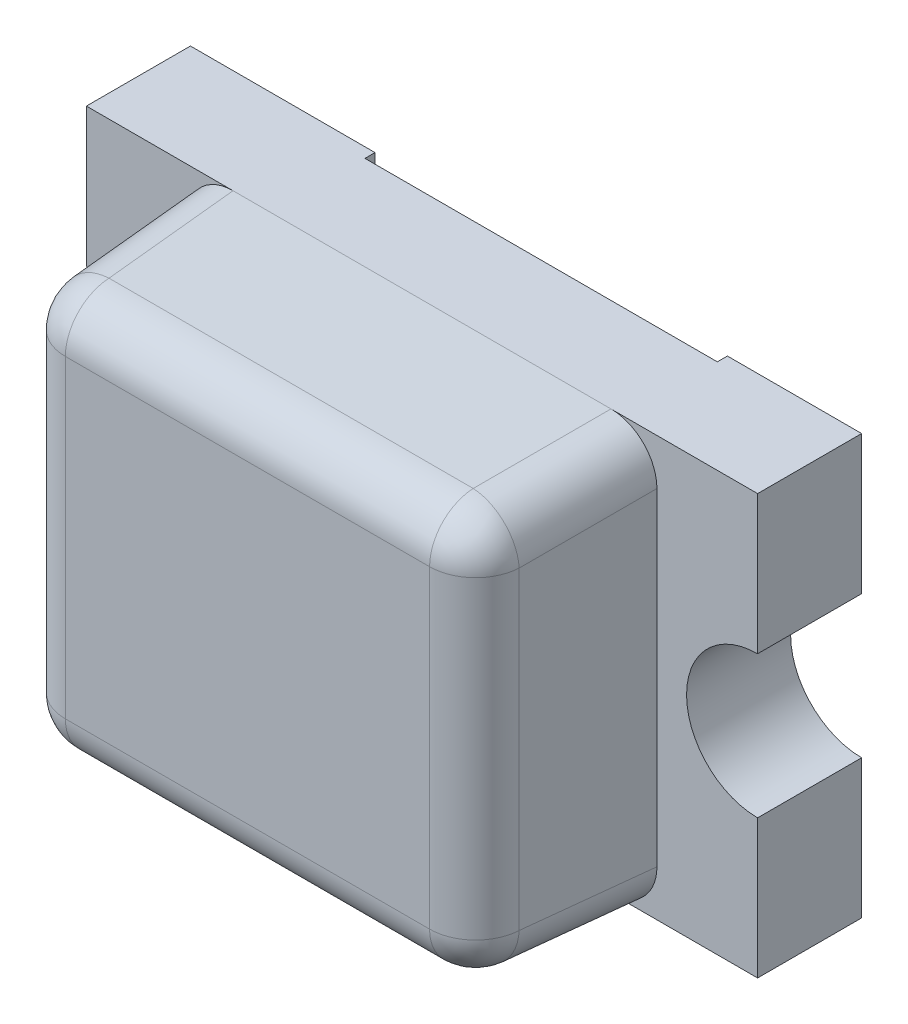
ISO-10303-21;
HEADER;
FILE_DESCRIPTION(('STEP AP214'),'2;1');
FILE_NAME('part.step','',(''),(''),'','','');
FILE_SCHEMA(('AUTOMOTIVE_DESIGN { 1 0 10303 214 1 1 1 1 }'));
ENDSEC;
DATA;
#1=APPLICATION_CONTEXT('core data for automotive mechanical design processes');
#2=APPLICATION_PROTOCOL_DEFINITION('international standard','automotive_design',2000,#1);
#3=PRODUCT_CONTEXT('',#1,'mechanical');
#4=PRODUCT('Part','Part','',(#3));
#5=PRODUCT_RELATED_PRODUCT_CATEGORY('part','',(#4));
#6=PRODUCT_DEFINITION_FORMATION('','',#4);
#7=PRODUCT_DEFINITION_CONTEXT('part definition',#1,'design');
#8=PRODUCT_DEFINITION('design','',#6,#7);
#9=PRODUCT_DEFINITION_SHAPE('','',#8);
#10=(LENGTH_UNIT() NAMED_UNIT(*) SI_UNIT(.MILLI.,.METRE.));
#11=(NAMED_UNIT(*) PLANE_ANGLE_UNIT() SI_UNIT($,.RADIAN.));
#12=(NAMED_UNIT(*) SI_UNIT($,.STERADIAN.) SOLID_ANGLE_UNIT());
#13=UNCERTAINTY_MEASURE_WITH_UNIT(LENGTH_MEASURE(1.E-05),#10,'distance_accuracy_value','');
#14=(GEOMETRIC_REPRESENTATION_CONTEXT(3) GLOBAL_UNCERTAINTY_ASSIGNED_CONTEXT((#13)) GLOBAL_UNIT_ASSIGNED_CONTEXT((#10,
#11,#12)) REPRESENTATION_CONTEXT('',''));
#15=CARTESIAN_POINT('',(0.,0.,0.));
#16=DIRECTION('',(0.,0.,1.));
#17=DIRECTION('',(1.,0.,0.));
#18=AXIS2_PLACEMENT_3D('',#15,#16,#17);
#19=CARTESIAN_POINT('',(0.163168531233106,-0.486831468766896,0.325652261310296));
#20=DIRECTION('',(-0.0522644276887139,-0.0522644276887139,-0.997264688634237));
#21=DIRECTION('',(0.,0.998629534754574,-0.0523359562429438));
#22=AXIS2_PLACEMENT_3D('',#19,#20,#21);
#23=CYLINDRICAL_SURFACE('',#22,0.13716);
#24=CARTESIAN_POINT('',(0.182412025197795,-0.467587974802207,0.69284));
#25=DIRECTION('',(0.052264427688714,0.052264427688714,0.997264688634237));
#26=DIRECTION('',(0.,-0.998629534754574,0.0523359562429439));
#27=AXIS2_PLACEMENT_3D('',#24,#25,#26);
#28=CIRCLE('',#27,0.13716);
#29=CARTESIAN_POINT('',(0.0454399982108576,-0.467587974802207,0.700018399758282));
#30=VERTEX_POINT('',#29);
#31=CARTESIAN_POINT('',(0.182412025197795,-0.604560001789144,0.700018399758282));
#32=VERTEX_POINT('',#31);
#33=EDGE_CURVE('E305',#30,#32,#28,.T.);
#34=ORIENTED_EDGE('',*,*,#33,.F.);
#35=DIRECTION('',(0.0522644276887139,0.0522644276887139,0.997264688634237));
#36=VECTOR('',#35,1.);
#37=CARTESIAN_POINT('',(0.02633308276625,-0.486694890246814,0.335436734478859));
#38=LINE('',#37,#36);
#39=CARTESIAN_POINT('',(0.0250000000000006,-0.488027973013064,0.31));
#40=VERTEX_POINT('',#39);
#41=EDGE_CURVE('E43',#40,#30,#38,.T.);
#42=ORIENTED_EDGE('',*,*,#41,.F.);
#43=CARTESIAN_POINT('',(0.162348230977076,-0.487651769022926,0.31));
#44=DIRECTION('',(0.,0.,1.));
#45=DIRECTION('',(-0.707106781186547,-0.707106781186548,0.));
#46=AXIS2_PLACEMENT_3D('',#43,#44,#45);
#47=ELLIPSE('',#46,0.137536204342943,0.13716);
#48=CARTESIAN_POINT('',(0.161972026986938,-0.625,0.31));
#49=VERTEX_POINT('',#48);
#50=EDGE_CURVE('E11',#40,#49,#47,.T.);
#51=ORIENTED_EDGE('',*,*,#50,.T.);
#52=DIRECTION('',(0.0522644276887139,0.0522644276887139,0.997264688634237));
#53=VECTOR('',#52,1.);
#54=CARTESIAN_POINT('',(0.163168531233106,-0.623803495753833,0.332830661068578));
#55=LINE('',#54,#53);
#56=EDGE_CURVE('E29',#49,#32,#55,.T.);
#57=ORIENTED_EDGE('',*,*,#56,.T.);
#58=EDGE_LOOP('',(#34,#42,#51,#57));
#59=FACE_BOUND('',#58,.T.);
#60=ADVANCED_FACE('F18',(#59),#23,.T.);
#61=CARTESIAN_POINT('',(0.182412025197795,-0.467587974802207,0.69284));
#62=DIRECTION('',(0.,0.,1.));
#63=DIRECTION('',(1.,0.,0.));
#64=AXIS2_PLACEMENT_3D('',#61,#62,#63);
#65=SPHERICAL_SURFACE('',#64,0.13716);
#66=CARTESIAN_POINT('',(0.182412025197795,-0.467587974802207,0.69284));
#67=DIRECTION('',(-1.,0.,0.));
#68=DIRECTION('',(0.,0.,1.));
#69=AXIS2_PLACEMENT_3D('',#66,#67,#68);
#70=CIRCLE('',#69,0.13716);
#71=CARTESIAN_POINT('',(0.182412025197795,-0.467587974802207,0.83));
#72=VERTEX_POINT('',#71);
#73=EDGE_CURVE('E304',#32,#72,#70,.T.);
#74=ORIENTED_EDGE('',*,*,#73,.T.);
#75=CARTESIAN_POINT('',(0.182412025197795,-0.467587974802207,0.69284));
#76=DIRECTION('',(0.,-1.,0.));
#77=DIRECTION('',(0.,0.,-1.));
#78=AXIS2_PLACEMENT_3D('',#75,#76,#77);
#79=CIRCLE('',#78,0.13716);
#80=EDGE_CURVE('E300',#72,#30,#79,.T.);
#81=ORIENTED_EDGE('',*,*,#80,.T.);
#82=ORIENTED_EDGE('',*,*,#33,.T.);
#83=EDGE_LOOP('',(#74,#81,#82));
#84=FACE_BOUND('',#83,.T.);
#85=ADVANCED_FACE('F898',(#84),#65,.T.);
#86=CARTESIAN_POINT('',(0.,-0.467587974802207,0.69284));
#87=DIRECTION('',(1.,0.,0.));
#88=DIRECTION('',(0.,1.,0.));
#89=AXIS2_PLACEMENT_3D('',#86,#87,#88);
#90=CYLINDRICAL_SURFACE('',#89,0.13716);
#91=CARTESIAN_POINT('',(1.26758797480221,-0.467587974802207,0.69284));
#92=DIRECTION('',(1.,0.,0.));
#93=DIRECTION('',(0.,0.,-1.));
#94=AXIS2_PLACEMENT_3D('',#91,#92,#93);
#95=CIRCLE('',#94,0.13716);
#96=CARTESIAN_POINT('',(1.26758797480221,-0.467587974802207,0.83));
#97=VERTEX_POINT('',#96);
#98=CARTESIAN_POINT('',(1.26758797480221,-0.604560001789144,0.700018399758282));
#99=VERTEX_POINT('',#98);
#100=EDGE_CURVE('E365',#97,#99,#95,.T.);
#101=ORIENTED_EDGE('',*,*,#100,.F.);
#102=DIRECTION('',(-1.,0.,0.));
#103=VECTOR('',#102,1.);
#104=CARTESIAN_POINT('',(1.39774795477282,-0.467587974802207,0.83));
#105=LINE('',#104,#103);
#106=EDGE_CURVE('E464',#97,#72,#105,.T.);
#107=ORIENTED_EDGE('',*,*,#106,.T.);
#108=ORIENTED_EDGE('',*,*,#73,.F.);
#109=DIRECTION('',(1.,0.,0.));
#110=VECTOR('',#109,1.);
#111=CARTESIAN_POINT('',(0.0522520452271821,-0.604560001789144,0.700018399758282));
#112=LINE('',#111,#110);
#113=EDGE_CURVE('E468',#32,#99,#112,.T.);
#114=ORIENTED_EDGE('',*,*,#113,.T.);
#115=EDGE_LOOP('',(#101,#107,#108,#114));
#116=FACE_BOUND('',#115,.T.);
#117=ADVANCED_FACE('F844',(#116),#90,.T.);
#118=CARTESIAN_POINT('',(0.182412025197795,0.,0.69284));
#119=DIRECTION('',(0.,-1.,0.));
#120=DIRECTION('',(1.,0.,0.));
#121=AXIS2_PLACEMENT_3D('',#118,#119,#120);
#122=CYLINDRICAL_SURFACE('',#121,0.13716);
#123=CARTESIAN_POINT('',(0.182412025197795,0.467587974802206,0.69284));
#124=DIRECTION('',(0.,1.,0.));
#125=DIRECTION('',(0.,0.,1.));
#126=AXIS2_PLACEMENT_3D('',#123,#124,#125);
#127=CIRCLE('',#126,0.13716);
#128=CARTESIAN_POINT('',(0.0454399982108576,0.467587974802206,0.700018399758282));
#129=VERTEX_POINT('',#128);
#130=CARTESIAN_POINT('',(0.182412025197795,0.467587974802206,0.83));
#131=VERTEX_POINT('',#130);
#132=EDGE_CURVE('E371',#129,#131,#127,.T.);
#133=ORIENTED_EDGE('',*,*,#132,.F.);
#134=DIRECTION('',(0.,-1.,0.));
#135=VECTOR('',#134,1.);
#136=CARTESIAN_POINT('',(0.0454399982108575,0.597747954772819,0.700018399758282));
#137=LINE('',#136,#135);
#138=EDGE_CURVE('E309',#129,#30,#137,.T.);
#139=ORIENTED_EDGE('',*,*,#138,.T.);
#140=ORIENTED_EDGE('',*,*,#80,.F.);
#141=DIRECTION('',(0.,1.,0.));
#142=VECTOR('',#141,1.);
#143=CARTESIAN_POINT('',(0.182412025197795,-0.597747954772819,0.83));
#144=LINE('',#143,#142);
#145=EDGE_CURVE('E298',#72,#131,#144,.T.);
#146=ORIENTED_EDGE('',*,*,#145,.T.);
#147=EDGE_LOOP('',(#133,#139,#140,#146));
#148=FACE_BOUND('',#147,.T.);
#149=ADVANCED_FACE('F627',(#148),#122,.T.);
#150=CARTESIAN_POINT('',(1.26758797480221,-0.467587974802207,0.69284));
#151=DIRECTION('',(0.,0.,1.));
#152=DIRECTION('',(1.,0.,0.));
#153=AXIS2_PLACEMENT_3D('',#150,#151,#152);
#154=SPHERICAL_SURFACE('',#153,0.13716);
#155=CARTESIAN_POINT('',(1.26758797480221,-0.467587974802206,0.69284));
#156=DIRECTION('',(-0.052264427688714,0.052264427688714,0.997264688634237));
#157=DIRECTION('',(0.,-0.998629534754574,0.0523359562429439));
#158=AXIS2_PLACEMENT_3D('',#155,#156,#157);
#159=CIRCLE('',#158,0.13716);
#160=CARTESIAN_POINT('',(1.40456000178914,-0.467587974802207,0.700018399758282));
#161=VERTEX_POINT('',#160);
#162=EDGE_CURVE('E294',#99,#161,#159,.T.);
#163=ORIENTED_EDGE('',*,*,#162,.T.);
#164=CARTESIAN_POINT('',(1.26758797480221,-0.467587974802207,0.69284));
#165=DIRECTION('',(0.,-1.,0.));
#166=DIRECTION('',(0.,0.,-1.));
#167=AXIS2_PLACEMENT_3D('',#164,#165,#166);
#168=CIRCLE('',#167,0.13716);
#169=EDGE_CURVE('E299',#161,#97,#168,.T.);
#170=ORIENTED_EDGE('',*,*,#169,.T.);
#171=ORIENTED_EDGE('',*,*,#100,.T.);
#172=EDGE_LOOP('',(#163,#170,#171));
#173=FACE_BOUND('',#172,.T.);
#174=ADVANCED_FACE('F819',(#173),#154,.T.);
#175=CARTESIAN_POINT('',(0.182412025197795,0.467587974802206,0.69284));
#176=DIRECTION('',(0.,0.,1.));
#177=DIRECTION('',(1.,0.,0.));
#178=AXIS2_PLACEMENT_3D('',#175,#176,#177);
#179=SPHERICAL_SURFACE('',#178,0.13716);
#180=CARTESIAN_POINT('',(0.182412025197795,0.467587974802206,0.69284));
#181=DIRECTION('',(-1.,0.,0.));
#182=DIRECTION('',(0.,-1.,0.));
#183=AXIS2_PLACEMENT_3D('',#180,#181,#182);
#184=CIRCLE('',#183,0.13716);
#185=CARTESIAN_POINT('',(0.182412025197795,0.604560001789144,0.700018399758282));
#186=VERTEX_POINT('',#185);
#187=EDGE_CURVE('E370',#131,#186,#184,.T.);
#188=ORIENTED_EDGE('',*,*,#187,.T.);
#189=CARTESIAN_POINT('',(0.182412025197795,0.467587974802206,0.69284));
#190=DIRECTION('',(0.052264427688714,-0.052264427688714,0.997264688634237));
#191=DIRECTION('',(0.998629534754574,0.,-0.0523359562429439));
#192=AXIS2_PLACEMENT_3D('',#189,#190,#191);
#193=CIRCLE('',#192,0.13716);
#194=EDGE_CURVE('E366',#186,#129,#193,.T.);
#195=ORIENTED_EDGE('',*,*,#194,.T.);
#196=ORIENTED_EDGE('',*,*,#132,.T.);
#197=EDGE_LOOP('',(#188,#195,#196));
#198=FACE_BOUND('',#197,.T.);
#199=ADVANCED_FACE('F619',(#198),#179,.T.);
#200=CARTESIAN_POINT('',(1.28669489024681,-0.486694890246814,0.328258334720577));
#201=DIRECTION('',(0.0522644276887139,-0.0522644276887139,-0.997264688634237));
#202=DIRECTION('',(-0.998629534754574,0.,-0.0523359562429438));
#203=AXIS2_PLACEMENT_3D('',#200,#201,#202);
#204=CYLINDRICAL_SURFACE('',#203,0.13716);
#205=CARTESIAN_POINT('',(1.28765176902293,-0.487651769022926,0.31));
#206=DIRECTION('',(0.,0.,1.));
#207=DIRECTION('',(0.707106781186548,-0.707106781186547,0.));
#208=AXIS2_PLACEMENT_3D('',#205,#206,#207);
#209=ELLIPSE('',#208,0.137536204342943,0.13716);
#210=CARTESIAN_POINT('',(1.28802797301306,-0.625,0.31));
#211=VERTEX_POINT('',#210);
#212=CARTESIAN_POINT('',(1.425,-0.488027973013063,0.31));
#213=VERTEX_POINT('',#212);
#214=EDGE_CURVE('E459',#211,#213,#209,.T.);
#215=ORIENTED_EDGE('',*,*,#214,.T.);
#216=DIRECTION('',(-0.0522644276887139,0.0522644276887139,0.997264688634237));
#217=VECTOR('',#216,1.);
#218=CARTESIAN_POINT('',(1.42366691723375,-0.486694890246814,0.335436734478859));
#219=LINE('',#218,#217);
#220=EDGE_CURVE('E463',#213,#161,#219,.T.);
#221=ORIENTED_EDGE('',*,*,#220,.T.);
#222=ORIENTED_EDGE('',*,*,#162,.F.);
#223=DIRECTION('',(-0.0522644276887139,0.0522644276887139,0.997264688634237));
#224=VECTOR('',#223,1.);
#225=CARTESIAN_POINT('',(1.28614857616649,-0.623120603153426,0.345861028119986));
#226=LINE('',#225,#224);
#227=EDGE_CURVE('E313',#211,#99,#226,.T.);
#228=ORIENTED_EDGE('',*,*,#227,.F.);
#229=EDGE_LOOP('',(#215,#221,#222,#228));
#230=FACE_BOUND('',#229,.T.);
#231=ADVANCED_FACE('F854',(#230),#204,.T.);
#232=CARTESIAN_POINT('',(1.26758797480221,0.,0.69284));
#233=DIRECTION('',(0.,1.,0.));
#234=DIRECTION('',(-1.,0.,0.));
#235=AXIS2_PLACEMENT_3D('',#232,#233,#234);
#236=CYLINDRICAL_SURFACE('',#235,0.13716);
#237=CARTESIAN_POINT('',(1.26758797480221,0.467587974802206,0.69284));
#238=DIRECTION('',(0.,1.,0.));
#239=DIRECTION('',(0.,0.,1.));
#240=AXIS2_PLACEMENT_3D('',#237,#238,#239);
#241=CIRCLE('',#240,0.13716);
#242=CARTESIAN_POINT('',(1.26758797480221,0.467587974802206,0.83));
#243=VERTEX_POINT('',#242);
#244=CARTESIAN_POINT('',(1.40456000178914,0.467587974802206,0.700018399758282));
#245=VERTEX_POINT('',#244);
#246=EDGE_CURVE('E348',#243,#245,#241,.T.);
#247=ORIENTED_EDGE('',*,*,#246,.F.);
#248=DIRECTION('',(0.,-1.,0.));
#249=VECTOR('',#248,1.);
#250=CARTESIAN_POINT('',(1.26758797480221,0.597747954772819,0.83));
#251=LINE('',#250,#249);
#252=EDGE_CURVE('E282',#243,#97,#251,.T.);
#253=ORIENTED_EDGE('',*,*,#252,.T.);
#254=ORIENTED_EDGE('',*,*,#169,.F.);
#255=DIRECTION('',(0.,1.,0.));
#256=VECTOR('',#255,1.);
#257=CARTESIAN_POINT('',(1.40456000178914,-0.597747954772819,0.700018399758282));
#258=LINE('',#257,#256);
#259=EDGE_CURVE('E278',#161,#245,#258,.T.);
#260=ORIENTED_EDGE('',*,*,#259,.T.);
#261=EDGE_LOOP('',(#247,#253,#254,#260));
#262=FACE_BOUND('',#261,.T.);
#263=ADVANCED_FACE('F635',(#262),#236,.T.);
#264=CARTESIAN_POINT('',(0.,0.467587974802206,0.69284));
#265=DIRECTION('',(-1.,0.,0.));
#266=DIRECTION('',(0.,0.,1.));
#267=AXIS2_PLACEMENT_3D('',#264,#265,#266);
#268=CYLINDRICAL_SURFACE('',#267,0.13716);
#269=CARTESIAN_POINT('',(1.26758797480221,0.467587974802206,0.69284));
#270=DIRECTION('',(1.,0.,0.));
#271=DIRECTION('',(0.,0.,-1.));
#272=AXIS2_PLACEMENT_3D('',#269,#270,#271);
#273=CIRCLE('',#272,0.13716);
#274=CARTESIAN_POINT('',(1.26758797480221,0.604560001789144,0.700018399758282));
#275=VERTEX_POINT('',#274);
#276=EDGE_CURVE('E376',#275,#243,#273,.T.);
#277=ORIENTED_EDGE('',*,*,#276,.F.);
#278=DIRECTION('',(-1.,0.,0.));
#279=VECTOR('',#278,1.);
#280=CARTESIAN_POINT('',(1.39774795477282,0.604560001789144,0.700018399758282));
#281=LINE('',#280,#279);
#282=EDGE_CURVE('E283',#275,#186,#281,.T.);
#283=ORIENTED_EDGE('',*,*,#282,.T.);
#284=ORIENTED_EDGE('',*,*,#187,.F.);
#285=DIRECTION('',(1.,0.,0.));
#286=VECTOR('',#285,1.);
#287=CARTESIAN_POINT('',(0.052252045227182,0.467587974802206,0.83));
#288=LINE('',#287,#286);
#289=EDGE_CURVE('E361',#131,#243,#288,.T.);
#290=ORIENTED_EDGE('',*,*,#289,.T.);
#291=EDGE_LOOP('',(#277,#283,#284,#290));
#292=FACE_BOUND('',#291,.T.);
#293=ADVANCED_FACE('F622',(#292),#268,.T.);
#294=CARTESIAN_POINT('',(0.163305109753187,0.486694890246814,0.328258334720577));
#295=DIRECTION('',(-0.0522644276887139,0.0522644276887139,-0.997264688634237));
#296=DIRECTION('',(-0.998629534754574,0.,0.0523359562429438));
#297=AXIS2_PLACEMENT_3D('',#294,#295,#296);
#298=CYLINDRICAL_SURFACE('',#297,0.13716);
#299=CARTESIAN_POINT('',(0.162348230977075,0.487651769022926,0.31));
#300=DIRECTION('',(0.,0.,1.));
#301=DIRECTION('',(-0.707106781186548,0.707106781186548,0.));
#302=AXIS2_PLACEMENT_3D('',#299,#300,#301);
#303=ELLIPSE('',#302,0.137536204342943,0.13716);
#304=CARTESIAN_POINT('',(0.161972026986938,0.625,0.31));
#305=VERTEX_POINT('',#304);
#306=CARTESIAN_POINT('',(0.0250000000000006,0.488027973013063,0.31));
#307=VERTEX_POINT('',#306);
#308=EDGE_CURVE('E357',#305,#307,#303,.T.);
#309=ORIENTED_EDGE('',*,*,#308,.T.);
#310=DIRECTION('',(0.0522644276887139,-0.0522644276887139,0.997264688634237));
#311=VECTOR('',#310,1.);
#312=CARTESIAN_POINT('',(0.02633308276625,0.486694890246814,0.335436734478859));
#313=LINE('',#312,#311);
#314=EDGE_CURVE('E352',#307,#129,#313,.T.);
#315=ORIENTED_EDGE('',*,*,#314,.T.);
#316=ORIENTED_EDGE('',*,*,#194,.F.);
#317=DIRECTION('',(0.0522644276887139,-0.0522644276887139,0.997264688634237));
#318=VECTOR('',#317,1.);
#319=CARTESIAN_POINT('',(0.163168531233106,0.623803495753833,0.332830661068578));
#320=LINE('',#319,#318);
#321=EDGE_CURVE('E272',#305,#186,#320,.T.);
#322=ORIENTED_EDGE('',*,*,#321,.F.);
#323=EDGE_LOOP('',(#309,#315,#316,#322));
#324=FACE_BOUND('',#323,.T.);
#325=ADVANCED_FACE('F421',(#324),#298,.T.);
#326=CARTESIAN_POINT('',(1.26758797480221,0.467587974802206,0.69284));
#327=DIRECTION('',(0.,0.,1.));
#328=DIRECTION('',(1.,0.,0.));
#329=AXIS2_PLACEMENT_3D('',#326,#327,#328);
#330=SPHERICAL_SURFACE('',#329,0.13716);
#331=ORIENTED_EDGE('',*,*,#246,.T.);
#332=CARTESIAN_POINT('',(1.26758797480221,0.467587974802206,0.69284));
#333=DIRECTION('',(-0.052264427688714,-0.0522644276887141,0.997264688634237));
#334=DIRECTION('',(0.,-0.998629534754574,-0.052335956242944));
#335=AXIS2_PLACEMENT_3D('',#332,#333,#334);
#336=CIRCLE('',#335,0.13716);
#337=EDGE_CURVE('E353',#245,#275,#336,.T.);
#338=ORIENTED_EDGE('',*,*,#337,.T.);
#339=ORIENTED_EDGE('',*,*,#276,.T.);
#340=EDGE_LOOP('',(#331,#338,#339));
#341=FACE_BOUND('',#340,.T.);
#342=ADVANCED_FACE('F638',(#341),#330,.T.);
#343=CARTESIAN_POINT('',(1.28614857616649,0.486148576166488,0.338682628361704));
#344=DIRECTION('',(0.0522644276887139,0.0522644276887139,-0.997264688634237));
#345=DIRECTION('',(0.,0.998629534754574,0.0523359562429438));
#346=AXIS2_PLACEMENT_3D('',#343,#344,#345);
#347=CYLINDRICAL_SURFACE('',#346,0.13716);
#348=ORIENTED_EDGE('',*,*,#337,.F.);
#349=DIRECTION('',(-0.0522644276887139,-0.0522644276887139,0.997264688634237));
#350=VECTOR('',#349,1.);
#351=CARTESIAN_POINT('',(1.42366691723375,0.486694890246814,0.335436734478859));
#352=LINE('',#351,#350);
#353=CARTESIAN_POINT('',(1.425,0.488027973013063,0.31));
#354=VERTEX_POINT('',#353);
#355=EDGE_CURVE('E277',#354,#245,#352,.T.);
#356=ORIENTED_EDGE('',*,*,#355,.F.);
#357=CARTESIAN_POINT('',(1.28765176902293,0.487651769022926,0.31));
#358=DIRECTION('',(0.,0.,1.));
#359=DIRECTION('',(0.707106781186548,0.707106781186548,0.));
#360=AXIS2_PLACEMENT_3D('',#357,#358,#359);
#361=ELLIPSE('',#360,0.137536204342943,0.13716);
#362=CARTESIAN_POINT('',(1.28802797301306,0.625,0.31));
#363=VERTEX_POINT('',#362);
#364=EDGE_CURVE('E372',#354,#363,#361,.T.);
#365=ORIENTED_EDGE('',*,*,#364,.T.);
#366=DIRECTION('',(-0.0522644276887139,-0.0522644276887139,0.997264688634237));
#367=VECTOR('',#366,1.);
#368=CARTESIAN_POINT('',(1.28614857616649,0.623120603153425,0.345861028119986));
#369=LINE('',#368,#367);
#370=EDGE_CURVE('E276',#363,#275,#369,.T.);
#371=ORIENTED_EDGE('',*,*,#370,.T.);
#372=EDGE_LOOP('',(#348,#356,#365,#371));
#373=FACE_BOUND('',#372,.T.);
#374=ADVANCED_FACE('F640',(#373),#347,.T.);
#375=CARTESIAN_POINT('',(0.,0.,0.83));
#376=DIRECTION('',(0.,0.,1.));
#377=DIRECTION('',(1.,0.,0.));
#378=AXIS2_PLACEMENT_3D('',#375,#376,#377);
#379=PLANE('',#378);
#380=ORIENTED_EDGE('',*,*,#145,.F.);
#381=ORIENTED_EDGE('',*,*,#106,.F.);
#382=ORIENTED_EDGE('',*,*,#252,.F.);
#383=ORIENTED_EDGE('',*,*,#289,.F.);
#384=EDGE_LOOP('',(#380,#381,#382,#383));
#385=FACE_BOUND('',#384,.T.);
#386=ADVANCED_FACE('F631',(#385),#379,.T.);
#387=CARTESIAN_POINT('',(0.6,0.625,0.31));
#388=DIRECTION('',(0.,0.998629534754574,0.0523359562429438));
#389=DIRECTION('',(1.,0.,0.));
#390=AXIS2_PLACEMENT_3D('',#387,#388,#389);
#391=PLANE('',#390);
#392=DIRECTION('',(1.,0.,0.));
#393=VECTOR('',#392,1.);
#394=CARTESIAN_POINT('',(0.6,0.625,0.31));
#395=LINE('',#394,#393);
#396=EDGE_CURVE('E248',#305,#363,#395,.T.);
#397=ORIENTED_EDGE('',*,*,#396,.F.);
#398=ORIENTED_EDGE('',*,*,#321,.T.);
#399=ORIENTED_EDGE('',*,*,#282,.F.);
#400=ORIENTED_EDGE('',*,*,#370,.F.);
#401=EDGE_LOOP('',(#397,#398,#399,#400));
#402=FACE_BOUND('',#401,.T.);
#403=ADVANCED_FACE('F425',(#402),#391,.T.);
#404=CARTESIAN_POINT('',(1.425,0.,0.31));
#405=DIRECTION('',(0.998629534754574,0.,0.0523359562429438));
#406=DIRECTION('',(0.,-1.,0.));
#407=AXIS2_PLACEMENT_3D('',#404,#405,#406);
#408=PLANE('',#407);
#409=ORIENTED_EDGE('',*,*,#259,.F.);
#410=ORIENTED_EDGE('',*,*,#220,.F.);
#411=DIRECTION('',(0.,-1.,0.));
#412=VECTOR('',#411,1.);
#413=CARTESIAN_POINT('',(1.425,0.,0.31));
#414=LINE('',#413,#412);
#415=EDGE_CURVE('E398',#354,#213,#414,.T.);
#416=ORIENTED_EDGE('',*,*,#415,.F.);
#417=ORIENTED_EDGE('',*,*,#355,.T.);
#418=EDGE_LOOP('',(#409,#410,#416,#417));
#419=FACE_BOUND('',#418,.T.);
#420=ADVANCED_FACE('F690',(#419),#408,.T.);
#421=CARTESIAN_POINT('',(0.6,-0.625,0.31));
#422=DIRECTION('',(0.,-0.998629534754574,0.0523359562429438));
#423=DIRECTION('',(-1.,0.,0.));
#424=AXIS2_PLACEMENT_3D('',#421,#422,#423);
#425=PLANE('',#424);
#426=ORIENTED_EDGE('',*,*,#113,.F.);
#427=ORIENTED_EDGE('',*,*,#56,.F.);
#428=DIRECTION('',(-1.,0.,0.));
#429=VECTOR('',#428,1.);
#430=CARTESIAN_POINT('',(0.6,-0.625,0.31));
#431=LINE('',#430,#429);
#432=EDGE_CURVE('E317',#211,#49,#431,.T.);
#433=ORIENTED_EDGE('',*,*,#432,.F.);
#434=ORIENTED_EDGE('',*,*,#227,.T.);
#435=EDGE_LOOP('',(#426,#427,#433,#434));
#436=FACE_BOUND('',#435,.T.);
#437=ADVANCED_FACE('F695',(#436),#425,.T.);
#438=CARTESIAN_POINT('',(0.0250000000000006,0.,0.31));
#439=DIRECTION('',(-0.998629534754574,0.,0.0523359562429438));
#440=DIRECTION('',(0.,1.,0.));
#441=AXIS2_PLACEMENT_3D('',#438,#439,#440);
#442=PLANE('',#441);
#443=DIRECTION('',(0.,1.,0.));
#444=VECTOR('',#443,1.);
#445=CARTESIAN_POINT('',(0.0250000000000006,0.,0.31));
#446=LINE('',#445,#444);
#447=EDGE_CURVE('E256',#40,#307,#446,.T.);
#448=ORIENTED_EDGE('',*,*,#447,.F.);
#449=ORIENTED_EDGE('',*,*,#41,.T.);
#450=ORIENTED_EDGE('',*,*,#138,.F.);
#451=ORIENTED_EDGE('',*,*,#314,.F.);
#452=EDGE_LOOP('',(#448,#449,#450,#451));
#453=FACE_BOUND('',#452,.T.);
#454=ADVANCED_FACE('F413',(#453),#442,.T.);
#455=CARTESIAN_POINT('',(-0.275,0.,0.));
#456=DIRECTION('',(0.,0.,1.));
#457=DIRECTION('',(1.,0.,0.));
#458=AXIS2_PLACEMENT_3D('',#455,#456,#457);
#459=PLANE('',#458);
#460=DIRECTION('',(0.,1.,0.));
#461=VECTOR('',#460,1.);
#462=CARTESIAN_POINT('',(-0.275,0.211688070581402,0.));
#463=LINE('',#462,#461);
#464=CARTESIAN_POINT('',(-0.275,0.211688070581401,0.));
#465=VERTEX_POINT('',#464);
#466=CARTESIAN_POINT('',(-0.275,0.625,0.));
#467=VERTEX_POINT('',#466);
#468=EDGE_CURVE('E354',#465,#467,#463,.T.);
#469=ORIENTED_EDGE('',*,*,#468,.T.);
#470=DIRECTION('',(1.,0.,0.));
#471=VECTOR('',#470,1.);
#472=CARTESIAN_POINT('',(-0.275,0.625,0.));
#473=LINE('',#472,#471);
#474=CARTESIAN_POINT('',(0.275,0.625,0.));
#475=VERTEX_POINT('',#474);
#476=EDGE_CURVE('E230',#467,#475,#473,.T.);
#477=ORIENTED_EDGE('',*,*,#476,.T.);
#478=DIRECTION('',(0.,-1.,0.));
#479=VECTOR('',#478,1.);
#480=CARTESIAN_POINT('',(0.275,0.625,0.));
#481=LINE('',#480,#479);
#482=CARTESIAN_POINT('',(0.275,-0.625,0.));
#483=VERTEX_POINT('',#482);
#484=EDGE_CURVE('E223',#475,#483,#481,.T.);
#485=ORIENTED_EDGE('',*,*,#484,.T.);
#486=DIRECTION('',(-1.,0.,0.));
#487=VECTOR('',#486,1.);
#488=CARTESIAN_POINT('',(0.275,-0.625,0.));
#489=LINE('',#488,#487);
#490=CARTESIAN_POINT('',(-0.275,-0.625,0.));
#491=VERTEX_POINT('',#490);
#492=EDGE_CURVE('E212',#483,#491,#489,.T.);
#493=ORIENTED_EDGE('',*,*,#492,.T.);
#494=DIRECTION('',(0.,1.,0.));
#495=VECTOR('',#494,1.);
#496=CARTESIAN_POINT('',(-0.275,-0.625,0.));
#497=LINE('',#496,#495);
#498=CARTESIAN_POINT('',(-0.275,-0.211688070581402,0.));
#499=VERTEX_POINT('',#498);
#500=EDGE_CURVE('E224',#491,#499,#497,.T.);
#501=ORIENTED_EDGE('',*,*,#500,.T.);
#502=CARTESIAN_POINT('',(-0.275,0.,0.));
#503=DIRECTION('',(0.,0.,1.));
#504=DIRECTION('',(-1.,0.,0.));
#505=AXIS2_PLACEMENT_3D('',#502,#503,#504);
#506=CIRCLE('',#505,0.211688070581401);
#507=EDGE_CURVE('E346',#499,#465,#506,.T.);
#508=ORIENTED_EDGE('',*,*,#507,.T.);
#509=EDGE_LOOP('',(#469,#477,#485,#493,#501,#508));
#510=FACE_BOUND('',#509,.T.);
#511=ADVANCED_FACE('F228',(#510),#459,.F.);
#512=CARTESIAN_POINT('',(-0.275,0.,0.03));
#513=DIRECTION('',(0.,0.,-1.));
#514=DIRECTION('',(-1.,0.,0.));
#515=AXIS2_PLACEMENT_3D('',#512,#513,#514);
#516=CYLINDRICAL_SURFACE('',#515,0.211688070581401);
#517=ORIENTED_EDGE('',*,*,#507,.F.);
#518=DIRECTION('',(0.,0.,-1.));
#519=VECTOR('',#518,1.);
#520=CARTESIAN_POINT('',(-0.275,-0.211688070581402,0.03));
#521=LINE('',#520,#519);
#522=CARTESIAN_POINT('',(-0.275,-0.211688070581402,0.31));
#523=VERTEX_POINT('',#522);
#524=EDGE_CURVE('E390',#523,#499,#521,.T.);
#525=ORIENTED_EDGE('',*,*,#524,.F.);
#526=CARTESIAN_POINT('',(-0.275,0.,0.31));
#527=DIRECTION('',(0.,0.,1.));
#528=DIRECTION('',(-1.,0.,0.));
#529=AXIS2_PLACEMENT_3D('',#526,#527,#528);
#530=CIRCLE('',#529,0.211688070581401);
#531=CARTESIAN_POINT('',(-0.275,0.211688070581401,0.31));
#532=VERTEX_POINT('',#531);
#533=EDGE_CURVE('E342',#523,#532,#530,.T.);
#534=ORIENTED_EDGE('',*,*,#533,.T.);
#535=DIRECTION('',(0.,0.,-1.));
#536=VECTOR('',#535,1.);
#537=CARTESIAN_POINT('',(-0.275,0.211688070581401,0.03));
#538=LINE('',#537,#536);
#539=EDGE_CURVE('E347',#532,#465,#538,.T.);
#540=ORIENTED_EDGE('',*,*,#539,.T.);
#541=EDGE_LOOP('',(#517,#525,#534,#540));
#542=FACE_BOUND('',#541,.T.);
#543=ADVANCED_FACE('F584',(#542),#516,.F.);
#544=CARTESIAN_POINT('',(-0.275,-0.625,0.03));
#545=DIRECTION('',(-1.,0.,0.));
#546=DIRECTION('',(0.,0.,1.));
#547=AXIS2_PLACEMENT_3D('',#544,#545,#546);
#548=PLANE('',#547);
#549=ORIENTED_EDGE('',*,*,#500,.F.);
#550=DIRECTION('',(0.,0.,-1.));
#551=VECTOR('',#550,1.);
#552=CARTESIAN_POINT('',(-0.275,-0.625,0.03));
#553=LINE('',#552,#551);
#554=CARTESIAN_POINT('',(-0.275,-0.625,0.31));
#555=VERTEX_POINT('',#554);
#556=EDGE_CURVE('E219',#555,#491,#553,.T.);
#557=ORIENTED_EDGE('',*,*,#556,.F.);
#558=DIRECTION('',(0.,1.,0.));
#559=VECTOR('',#558,1.);
#560=CARTESIAN_POINT('',(-0.275,-0.211688070581402,0.31));
#561=LINE('',#560,#559);
#562=EDGE_CURVE('E386',#555,#523,#561,.T.);
#563=ORIENTED_EDGE('',*,*,#562,.T.);
#564=ORIENTED_EDGE('',*,*,#524,.T.);
#565=EDGE_LOOP('',(#549,#557,#563,#564));
#566=FACE_BOUND('',#565,.T.);
#567=ADVANCED_FACE('F588',(#566),#548,.T.);
#568=CARTESIAN_POINT('',(0.275,-0.625,0.03));
#569=DIRECTION('',(0.,-1.,0.));
#570=DIRECTION('',(0.,0.,-1.));
#571=AXIS2_PLACEMENT_3D('',#568,#569,#570);
#572=PLANE('',#571);
#573=ORIENTED_EDGE('',*,*,#492,.F.);
#574=DIRECTION('',(0.,0.,-1.));
#575=VECTOR('',#574,1.);
#576=CARTESIAN_POINT('',(0.275,-0.625,0.03));
#577=LINE('',#576,#575);
#578=CARTESIAN_POINT('',(0.275,-0.625,0.03));
#579=VERTEX_POINT('',#578);
#580=EDGE_CURVE('E216',#579,#483,#577,.T.);
#581=ORIENTED_EDGE('',*,*,#580,.F.);
#582=DIRECTION('',(-1.,0.,0.));
#583=VECTOR('',#582,1.);
#584=CARTESIAN_POINT('',(1.725,-0.625,0.03));
#585=LINE('',#584,#583);
#586=CARTESIAN_POINT('',(1.325,-0.625,0.03));
#587=VERTEX_POINT('',#586);
#588=EDGE_CURVE('E401',#587,#579,#585,.T.);
#589=ORIENTED_EDGE('',*,*,#588,.F.);
#590=DIRECTION('',(0.,0.,-1.));
#591=VECTOR('',#590,1.);
#592=CARTESIAN_POINT('',(1.325,-0.625,0.03));
#593=LINE('',#592,#591);
#594=CARTESIAN_POINT('',(1.325,-0.625,0.));
#595=VERTEX_POINT('',#594);
#596=EDGE_CURVE('E473',#587,#595,#593,.T.);
#597=ORIENTED_EDGE('',*,*,#596,.T.);
#598=DIRECTION('',(-1.,0.,0.));
#599=VECTOR('',#598,1.);
#600=CARTESIAN_POINT('',(1.725,-0.625,0.));
#601=LINE('',#600,#599);
#602=CARTESIAN_POINT('',(1.725,-0.625,0.));
#603=VERTEX_POINT('',#602);
#604=EDGE_CURVE('E451',#603,#595,#601,.T.);
#605=ORIENTED_EDGE('',*,*,#604,.F.);
#606=DIRECTION('',(0.,0.,-1.));
#607=VECTOR('',#606,1.);
#608=CARTESIAN_POINT('',(1.725,-0.625,0.03));
#609=LINE('',#608,#607);
#610=CARTESIAN_POINT('',(1.725,-0.625,0.31));
#611=VERTEX_POINT('',#610);
#612=EDGE_CURVE('E284',#611,#603,#609,.T.);
#613=ORIENTED_EDGE('',*,*,#612,.F.);
#614=DIRECTION('',(-1.,0.,0.));
#615=VECTOR('',#614,1.);
#616=CARTESIAN_POINT('',(1.725,-0.625,0.31));
#617=LINE('',#616,#615);
#618=EDGE_CURVE('E469',#611,#211,#617,.T.);
#619=ORIENTED_EDGE('',*,*,#618,.T.);
#620=ORIENTED_EDGE('',*,*,#432,.T.);
#621=DIRECTION('',(-1.,0.,0.));
#622=VECTOR('',#621,1.);
#623=CARTESIAN_POINT('',(1.725,-0.625,0.31));
#624=LINE('',#623,#622);
#625=EDGE_CURVE('E314',#49,#555,#624,.T.);
#626=ORIENTED_EDGE('',*,*,#625,.T.);
#627=ORIENTED_EDGE('',*,*,#556,.T.);
#628=EDGE_LOOP('',(#573,#581,#589,#597,#605,#613,#619,#620,#626,#627));
#629=FACE_BOUND('',#628,.T.);
#630=ADVANCED_FACE('F214',(#629),#572,.T.);
#631=CARTESIAN_POINT('',(0.275,0.625,0.03));
#632=DIRECTION('',(1.,0.,0.));
#633=DIRECTION('',(0.,1.,0.));
#634=AXIS2_PLACEMENT_3D('',#631,#632,#633);
#635=PLANE('',#634);
#636=ORIENTED_EDGE('',*,*,#484,.F.);
#637=DIRECTION('',(0.,0.,-1.));
#638=VECTOR('',#637,1.);
#639=CARTESIAN_POINT('',(0.275,0.625,0.03));
#640=LINE('',#639,#638);
#641=CARTESIAN_POINT('',(0.275,0.625,0.03));
#642=VERTEX_POINT('',#641);
#643=EDGE_CURVE('E293',#642,#475,#640,.T.);
#644=ORIENTED_EDGE('',*,*,#643,.F.);
#645=DIRECTION('',(0.,-1.,0.));
#646=VECTOR('',#645,1.);
#647=CARTESIAN_POINT('',(0.275,0.625,0.03));
#648=LINE('',#647,#646);
#649=EDGE_CURVE('E237',#642,#579,#648,.T.);
#650=ORIENTED_EDGE('',*,*,#649,.T.);
#651=ORIENTED_EDGE('',*,*,#580,.T.);
#652=EDGE_LOOP('',(#636,#644,#650,#651));
#653=FACE_BOUND('',#652,.T.);
#654=ADVANCED_FACE('F235',(#653),#635,.T.);
#655=CARTESIAN_POINT('',(-0.275,0.625,0.03));
#656=DIRECTION('',(0.,1.,0.));
#657=DIRECTION('',(1.,0.,0.));
#658=AXIS2_PLACEMENT_3D('',#655,#656,#657);
#659=PLANE('',#658);
#660=ORIENTED_EDGE('',*,*,#476,.F.);
#661=DIRECTION('',(0.,0.,-1.));
#662=VECTOR('',#661,1.);
#663=CARTESIAN_POINT('',(-0.275,0.625,0.03));
#664=LINE('',#663,#662);
#665=CARTESIAN_POINT('',(-0.275,0.625,0.31));
#666=VERTEX_POINT('',#665);
#667=EDGE_CURVE('E377',#666,#467,#664,.T.);
#668=ORIENTED_EDGE('',*,*,#667,.F.);
#669=DIRECTION('',(1.,0.,0.));
#670=VECTOR('',#669,1.);
#671=CARTESIAN_POINT('',(-0.275,0.625,0.31));
#672=LINE('',#671,#670);
#673=EDGE_CURVE('E239',#666,#305,#672,.T.);
#674=ORIENTED_EDGE('',*,*,#673,.T.);
#675=ORIENTED_EDGE('',*,*,#396,.T.);
#676=DIRECTION('',(1.,0.,0.));
#677=VECTOR('',#676,1.);
#678=CARTESIAN_POINT('',(-0.275,0.625,0.31));
#679=LINE('',#678,#677);
#680=CARTESIAN_POINT('',(1.725,0.625,0.31));
#681=VERTEX_POINT('',#680);
#682=EDGE_CURVE('E292',#363,#681,#679,.T.);
#683=ORIENTED_EDGE('',*,*,#682,.T.);
#684=DIRECTION('',(0.,0.,-1.));
#685=VECTOR('',#684,1.);
#686=CARTESIAN_POINT('',(1.725,0.625,0.03));
#687=LINE('',#686,#685);
#688=CARTESIAN_POINT('',(1.725,0.625,0.));
#689=VERTEX_POINT('',#688);
#690=EDGE_CURVE('E288',#681,#689,#687,.T.);
#691=ORIENTED_EDGE('',*,*,#690,.T.);
#692=DIRECTION('',(1.,0.,0.));
#693=VECTOR('',#692,1.);
#694=CARTESIAN_POINT('',(1.325,0.625,0.));
#695=LINE('',#694,#693);
#696=CARTESIAN_POINT('',(1.325,0.625,0.));
#697=VERTEX_POINT('',#696);
#698=EDGE_CURVE('E449',#697,#689,#695,.T.);
#699=ORIENTED_EDGE('',*,*,#698,.F.);
#700=DIRECTION('',(0.,0.,-1.));
#701=VECTOR('',#700,1.);
#702=CARTESIAN_POINT('',(1.325,0.625,0.03));
#703=LINE('',#702,#701);
#704=CARTESIAN_POINT('',(1.325,0.625,0.03));
#705=VERTEX_POINT('',#704);
#706=EDGE_CURVE('E254',#705,#697,#703,.T.);
#707=ORIENTED_EDGE('',*,*,#706,.F.);
#708=DIRECTION('',(1.,0.,0.));
#709=VECTOR('',#708,1.);
#710=CARTESIAN_POINT('',(-0.275,0.625,0.03));
#711=LINE('',#710,#709);
#712=EDGE_CURVE('E382',#642,#705,#711,.T.);
#713=ORIENTED_EDGE('',*,*,#712,.F.);
#714=ORIENTED_EDGE('',*,*,#643,.T.);
#715=EDGE_LOOP('',(#660,#668,#674,#675,#683,#691,#699,#707,#713,#714));
#716=FACE_BOUND('',#715,.T.);
#717=ADVANCED_FACE('F592',(#716),#659,.T.);
#718=CARTESIAN_POINT('',(-0.275,0.211688070581402,0.03));
#719=DIRECTION('',(-1.,0.,0.));
#720=DIRECTION('',(0.,0.,1.));
#721=AXIS2_PLACEMENT_3D('',#718,#719,#720);
#722=PLANE('',#721);
#723=ORIENTED_EDGE('',*,*,#468,.F.);
#724=ORIENTED_EDGE('',*,*,#539,.F.);
#725=DIRECTION('',(0.,1.,0.));
#726=VECTOR('',#725,1.);
#727=CARTESIAN_POINT('',(-0.275,0.211688070581401,0.31));
#728=LINE('',#727,#726);
#729=EDGE_CURVE('E381',#532,#666,#728,.T.);
#730=ORIENTED_EDGE('',*,*,#729,.T.);
#731=ORIENTED_EDGE('',*,*,#667,.T.);
#732=EDGE_LOOP('',(#723,#724,#730,#731));
#733=FACE_BOUND('',#732,.T.);
#734=ADVANCED_FACE('F591',(#733),#722,.T.);
#735=CARTESIAN_POINT('',(1.725,0.,0.03));
#736=DIRECTION('',(0.,0.,1.));
#737=DIRECTION('',(1.,0.,0.));
#738=AXIS2_PLACEMENT_3D('',#735,#736,#737);
#739=PLANE('',#738);
#740=ORIENTED_EDGE('',*,*,#649,.F.);
#741=ORIENTED_EDGE('',*,*,#712,.T.);
#742=DIRECTION('',(0.,1.,0.));
#743=VECTOR('',#742,1.);
#744=CARTESIAN_POINT('',(1.325,0.2,0.03));
#745=LINE('',#744,#743);
#746=CARTESIAN_POINT('',(1.325,0.2,0.03));
#747=VERTEX_POINT('',#746);
#748=EDGE_CURVE('E255',#747,#705,#745,.T.);
#749=ORIENTED_EDGE('',*,*,#748,.F.);
#750=DIRECTION('',(1.,0.,0.));
#751=VECTOR('',#750,1.);
#752=CARTESIAN_POINT('',(1.325,0.2,0.03));
#753=LINE('',#752,#751);
#754=CARTESIAN_POINT('',(1.175,0.2,0.03));
#755=VERTEX_POINT('',#754);
#756=EDGE_CURVE('E271',#755,#747,#753,.T.);
#757=ORIENTED_EDGE('',*,*,#756,.F.);
#758=DIRECTION('',(0.,1.,0.));
#759=VECTOR('',#758,1.);
#760=CARTESIAN_POINT('',(1.175,0.2,0.03));
#761=LINE('',#760,#759);
#762=CARTESIAN_POINT('',(1.175,-0.2,0.03));
#763=VERTEX_POINT('',#762);
#764=EDGE_CURVE('E266',#763,#755,#761,.T.);
#765=ORIENTED_EDGE('',*,*,#764,.F.);
#766=DIRECTION('',(-1.,0.,0.));
#767=VECTOR('',#766,1.);
#768=CARTESIAN_POINT('',(1.175,-0.2,0.03));
#769=LINE('',#768,#767);
#770=CARTESIAN_POINT('',(1.325,-0.2,0.03));
#771=VERTEX_POINT('',#770);
#772=EDGE_CURVE('E258',#771,#763,#769,.T.);
#773=ORIENTED_EDGE('',*,*,#772,.F.);
#774=DIRECTION('',(0.,1.,0.));
#775=VECTOR('',#774,1.);
#776=CARTESIAN_POINT('',(1.325,-0.625,0.03));
#777=LINE('',#776,#775);
#778=EDGE_CURVE('E325',#587,#771,#777,.T.);
#779=ORIENTED_EDGE('',*,*,#778,.F.);
#780=ORIENTED_EDGE('',*,*,#588,.T.);
#781=EDGE_LOOP('',(#740,#741,#749,#757,#765,#773,#779,#780));
#782=FACE_BOUND('',#781,.T.);
#783=ADVANCED_FACE('F594',(#782),#739,.F.);
#784=CARTESIAN_POINT('',(1.725,0.,0.31));
#785=DIRECTION('',(0.,0.,1.));
#786=DIRECTION('',(1.,0.,0.));
#787=AXIS2_PLACEMENT_3D('',#784,#785,#786);
#788=PLANE('',#787);
#789=ORIENTED_EDGE('',*,*,#415,.T.);
#790=ORIENTED_EDGE('',*,*,#214,.F.);
#791=ORIENTED_EDGE('',*,*,#618,.F.);
#792=DIRECTION('',(0.,-1.,0.));
#793=VECTOR('',#792,1.);
#794=CARTESIAN_POINT('',(1.725,-0.211688070581401,0.31));
#795=LINE('',#794,#793);
#796=CARTESIAN_POINT('',(1.725,-0.211688070581401,0.31));
#797=VERTEX_POINT('',#796);
#798=EDGE_CURVE('E22',#797,#611,#795,.T.);
#799=ORIENTED_EDGE('',*,*,#798,.F.);
#800=CARTESIAN_POINT('',(1.725,0.,0.31));
#801=DIRECTION('',(0.,0.,1.));
#802=DIRECTION('',(1.,0.,0.));
#803=AXIS2_PLACEMENT_3D('',#800,#801,#802);
#804=CIRCLE('',#803,0.211688070581401);
#805=CARTESIAN_POINT('',(1.725,0.211688070581401,0.31));
#806=VERTEX_POINT('',#805);
#807=EDGE_CURVE('E287',#806,#797,#804,.T.);
#808=ORIENTED_EDGE('',*,*,#807,.F.);
#809=DIRECTION('',(0.,-1.,0.));
#810=VECTOR('',#809,1.);
#811=CARTESIAN_POINT('',(1.725,0.625,0.31));
#812=LINE('',#811,#810);
#813=EDGE_CURVE('E516',#681,#806,#812,.T.);
#814=ORIENTED_EDGE('',*,*,#813,.F.);
#815=ORIENTED_EDGE('',*,*,#682,.F.);
#816=ORIENTED_EDGE('',*,*,#364,.F.);
#817=EDGE_LOOP('',(#789,#790,#791,#799,#808,#814,#815,#816));
#818=FACE_BOUND('',#817,.T.);
#819=ADVANCED_FACE('F646',(#818),#788,.T.);
#820=CARTESIAN_POINT('',(1.725,0.,0.));
#821=DIRECTION('',(0.,0.,1.));
#822=DIRECTION('',(1.,0.,0.));
#823=AXIS2_PLACEMENT_3D('',#820,#821,#822);
#824=PLANE('',#823);
#825=DIRECTION('',(0.,1.,0.));
#826=VECTOR('',#825,1.);
#827=CARTESIAN_POINT('',(1.325,0.2,0.));
#828=LINE('',#827,#826);
#829=CARTESIAN_POINT('',(1.325,0.2,0.));
#830=VERTEX_POINT('',#829);
#831=EDGE_CURVE('E402',#830,#697,#828,.T.);
#832=ORIENTED_EDGE('',*,*,#831,.T.);
#833=ORIENTED_EDGE('',*,*,#698,.T.);
#834=DIRECTION('',(0.,-1.,0.));
#835=VECTOR('',#834,1.);
#836=CARTESIAN_POINT('',(1.725,0.625,0.));
#837=LINE('',#836,#835);
#838=CARTESIAN_POINT('',(1.725,0.211688070581402,0.));
#839=VERTEX_POINT('',#838);
#840=EDGE_CURVE('E445',#689,#839,#837,.T.);
#841=ORIENTED_EDGE('',*,*,#840,.T.);
#842=CARTESIAN_POINT('',(1.725,0.,0.));
#843=DIRECTION('',(0.,0.,1.));
#844=DIRECTION('',(1.,0.,0.));
#845=AXIS2_PLACEMENT_3D('',#842,#843,#844);
#846=CIRCLE('',#845,0.211688070581401);
#847=CARTESIAN_POINT('',(1.725,-0.211688070581401,0.));
#848=VERTEX_POINT('',#847);
#849=EDGE_CURVE('E450',#839,#848,#846,.T.);
#850=ORIENTED_EDGE('',*,*,#849,.T.);
#851=DIRECTION('',(0.,-1.,0.));
#852=VECTOR('',#851,1.);
#853=CARTESIAN_POINT('',(1.725,-0.211688070581402,0.));
#854=LINE('',#853,#852);
#855=EDGE_CURVE('E454',#848,#603,#854,.T.);
#856=ORIENTED_EDGE('',*,*,#855,.T.);
#857=ORIENTED_EDGE('',*,*,#604,.T.);
#858=DIRECTION('',(0.,1.,0.));
#859=VECTOR('',#858,1.);
#860=CARTESIAN_POINT('',(1.325,-0.625,0.));
#861=LINE('',#860,#859);
#862=CARTESIAN_POINT('',(1.325,-0.2,0.));
#863=VERTEX_POINT('',#862);
#864=EDGE_CURVE('E334',#595,#863,#861,.T.);
#865=ORIENTED_EDGE('',*,*,#864,.T.);
#866=DIRECTION('',(-1.,0.,0.));
#867=VECTOR('',#866,1.);
#868=CARTESIAN_POINT('',(1.175,-0.2,0.));
#869=LINE('',#868,#867);
#870=CARTESIAN_POINT('',(1.175,-0.2,0.));
#871=VERTEX_POINT('',#870);
#872=EDGE_CURVE('E330',#863,#871,#869,.T.);
#873=ORIENTED_EDGE('',*,*,#872,.T.);
#874=DIRECTION('',(0.,1.,0.));
#875=VECTOR('',#874,1.);
#876=CARTESIAN_POINT('',(1.175,0.2,0.));
#877=LINE('',#876,#875);
#878=CARTESIAN_POINT('',(1.175,0.2,0.));
#879=VERTEX_POINT('',#878);
#880=EDGE_CURVE('E335',#871,#879,#877,.T.);
#881=ORIENTED_EDGE('',*,*,#880,.T.);
#882=DIRECTION('',(1.,0.,0.));
#883=VECTOR('',#882,1.);
#884=CARTESIAN_POINT('',(1.325,0.2,0.));
#885=LINE('',#884,#883);
#886=EDGE_CURVE('E339',#879,#830,#885,.T.);
#887=ORIENTED_EDGE('',*,*,#886,.T.);
#888=EDGE_LOOP('',(#832,#833,#841,#850,#856,#857,#865,#873,#881,#887));
#889=FACE_BOUND('',#888,.T.);
#890=ADVANCED_FACE('F546',(#889),#824,.F.);
#891=CARTESIAN_POINT('',(1.325,0.2,0.03));
#892=DIRECTION('',(0.,1.,0.));
#893=DIRECTION('',(1.,0.,0.));
#894=AXIS2_PLACEMENT_3D('',#891,#892,#893);
#895=PLANE('',#894);
#896=ORIENTED_EDGE('',*,*,#886,.F.);
#897=DIRECTION('',(0.,0.,-1.));
#898=VECTOR('',#897,1.);
#899=CARTESIAN_POINT('',(1.175,0.2,0.03));
#900=LINE('',#899,#898);
#901=EDGE_CURVE('E261',#755,#879,#900,.T.);
#902=ORIENTED_EDGE('',*,*,#901,.F.);
#903=ORIENTED_EDGE('',*,*,#756,.T.);
#904=DIRECTION('',(0.,0.,-1.));
#905=VECTOR('',#904,1.);
#906=CARTESIAN_POINT('',(1.325,0.2,0.03));
#907=LINE('',#906,#905);
#908=EDGE_CURVE('E267',#747,#830,#907,.T.);
#909=ORIENTED_EDGE('',*,*,#908,.T.);
#910=EDGE_LOOP('',(#896,#902,#903,#909));
#911=FACE_BOUND('',#910,.T.);
#912=ADVANCED_FACE('F20',(#911),#895,.T.);
#913=CARTESIAN_POINT('',(1.175,0.2,0.03));
#914=DIRECTION('',(-1.,0.,0.));
#915=DIRECTION('',(0.,0.,1.));
#916=AXIS2_PLACEMENT_3D('',#913,#914,#915);
#917=PLANE('',#916);
#918=ORIENTED_EDGE('',*,*,#880,.F.);
#919=DIRECTION('',(0.,0.,-1.));
#920=VECTOR('',#919,1.);
#921=CARTESIAN_POINT('',(1.175,-0.2,0.03));
#922=LINE('',#921,#920);
#923=EDGE_CURVE('E262',#763,#871,#922,.T.);
#924=ORIENTED_EDGE('',*,*,#923,.F.);
#925=ORIENTED_EDGE('',*,*,#764,.T.);
#926=ORIENTED_EDGE('',*,*,#901,.T.);
#927=EDGE_LOOP('',(#918,#924,#925,#926));
#928=FACE_BOUND('',#927,.T.);
#929=ADVANCED_FACE('F552',(#928),#917,.T.);
#930=CARTESIAN_POINT('',(1.175,-0.2,0.03));
#931=DIRECTION('',(0.,-1.,0.));
#932=DIRECTION('',(0.,0.,-1.));
#933=AXIS2_PLACEMENT_3D('',#930,#931,#932);
#934=PLANE('',#933);
#935=ORIENTED_EDGE('',*,*,#872,.F.);
#936=DIRECTION('',(0.,0.,-1.));
#937=VECTOR('',#936,1.);
#938=CARTESIAN_POINT('',(1.325,-0.2,0.03));
#939=LINE('',#938,#937);
#940=EDGE_CURVE('E326',#771,#863,#939,.T.);
#941=ORIENTED_EDGE('',*,*,#940,.F.);
#942=ORIENTED_EDGE('',*,*,#772,.T.);
#943=ORIENTED_EDGE('',*,*,#923,.T.);
#944=EDGE_LOOP('',(#935,#941,#942,#943));
#945=FACE_BOUND('',#944,.T.);
#946=ADVANCED_FACE('F666',(#945),#934,.T.);
#947=CARTESIAN_POINT('',(1.325,-0.625,0.03));
#948=DIRECTION('',(-1.,0.,0.));
#949=DIRECTION('',(0.,0.,1.));
#950=AXIS2_PLACEMENT_3D('',#947,#948,#949);
#951=PLANE('',#950);
#952=ORIENTED_EDGE('',*,*,#864,.F.);
#953=ORIENTED_EDGE('',*,*,#596,.F.);
#954=ORIENTED_EDGE('',*,*,#778,.T.);
#955=ORIENTED_EDGE('',*,*,#940,.T.);
#956=EDGE_LOOP('',(#952,#953,#954,#955));
#957=FACE_BOUND('',#956,.T.);
#958=ADVANCED_FACE('F602',(#957),#951,.T.);
#959=CARTESIAN_POINT('',(1.725,-0.211688070581402,0.03));
#960=DIRECTION('',(1.,0.,0.));
#961=DIRECTION('',(0.,1.,0.));
#962=AXIS2_PLACEMENT_3D('',#959,#960,#961);
#963=PLANE('',#962);
#964=ORIENTED_EDGE('',*,*,#855,.F.);
#965=DIRECTION('',(0.,0.,-1.));
#966=VECTOR('',#965,1.);
#967=CARTESIAN_POINT('',(1.725,-0.211688070581401,0.03));
#968=LINE('',#967,#966);
#969=EDGE_CURVE('E252',#797,#848,#968,.T.);
#970=ORIENTED_EDGE('',*,*,#969,.F.);
#971=ORIENTED_EDGE('',*,*,#798,.T.);
#972=ORIENTED_EDGE('',*,*,#612,.T.);
#973=EDGE_LOOP('',(#964,#970,#971,#972));
#974=FACE_BOUND('',#973,.T.);
#975=ADVANCED_FACE('F662',(#974),#963,.T.);
#976=CARTESIAN_POINT('',(1.725,0.,0.03));
#977=DIRECTION('',(0.,0.,-1.));
#978=DIRECTION('',(-1.,0.,0.));
#979=AXIS2_PLACEMENT_3D('',#976,#977,#978);
#980=CYLINDRICAL_SURFACE('',#979,0.211688070581401);
#981=ORIENTED_EDGE('',*,*,#849,.F.);
#982=DIRECTION('',(0.,0.,-1.));
#983=VECTOR('',#982,1.);
#984=CARTESIAN_POINT('',(1.725,0.211688070581402,0.03));
#985=LINE('',#984,#983);
#986=EDGE_CURVE('E321',#806,#839,#985,.T.);
#987=ORIENTED_EDGE('',*,*,#986,.F.);
#988=ORIENTED_EDGE('',*,*,#807,.T.);
#989=ORIENTED_EDGE('',*,*,#969,.T.);
#990=EDGE_LOOP('',(#981,#987,#988,#989));
#991=FACE_BOUND('',#990,.T.);
#992=ADVANCED_FACE('F657',(#991),#980,.F.);
#993=CARTESIAN_POINT('',(1.725,0.625,0.03));
#994=DIRECTION('',(1.,0.,0.));
#995=DIRECTION('',(0.,1.,0.));
#996=AXIS2_PLACEMENT_3D('',#993,#994,#995);
#997=PLANE('',#996);
#998=ORIENTED_EDGE('',*,*,#840,.F.);
#999=ORIENTED_EDGE('',*,*,#690,.F.);
#1000=ORIENTED_EDGE('',*,*,#813,.T.);
#1001=ORIENTED_EDGE('',*,*,#986,.T.);
#1002=EDGE_LOOP('',(#998,#999,#1000,#1001));
#1003=FACE_BOUND('',#1002,.T.);
#1004=ADVANCED_FACE('F652',(#1003),#997,.T.);
#1005=CARTESIAN_POINT('',(1.325,0.2,0.03));
#1006=DIRECTION('',(-1.,0.,0.));
#1007=DIRECTION('',(0.,0.,1.));
#1008=AXIS2_PLACEMENT_3D('',#1005,#1006,#1007);
#1009=PLANE('',#1008);
#1010=ORIENTED_EDGE('',*,*,#831,.F.);
#1011=ORIENTED_EDGE('',*,*,#908,.F.);
#1012=ORIENTED_EDGE('',*,*,#748,.T.);
#1013=ORIENTED_EDGE('',*,*,#706,.T.);
#1014=EDGE_LOOP('',(#1010,#1011,#1012,#1013));
#1015=FACE_BOUND('',#1014,.T.);
#1016=ADVANCED_FACE('F558',(#1015),#1009,.T.);
#1017=CARTESIAN_POINT('',(1.725,0.,0.31));
#1018=DIRECTION('',(0.,0.,1.));
#1019=DIRECTION('',(1.,0.,0.));
#1020=AXIS2_PLACEMENT_3D('',#1017,#1018,#1019);
#1021=PLANE('',#1020);
#1022=ORIENTED_EDGE('',*,*,#447,.T.);
#1023=ORIENTED_EDGE('',*,*,#308,.F.);
#1024=ORIENTED_EDGE('',*,*,#673,.F.);
#1025=ORIENTED_EDGE('',*,*,#729,.F.);
#1026=ORIENTED_EDGE('',*,*,#533,.F.);
#1027=ORIENTED_EDGE('',*,*,#562,.F.);
#1028=ORIENTED_EDGE('',*,*,#625,.F.);
#1029=ORIENTED_EDGE('',*,*,#50,.F.);
#1030=EDGE_LOOP('',(#1022,#1023,#1024,#1025,#1026,#1027,#1028,#1029));
#1031=FACE_BOUND('',#1030,.T.);
#1032=ADVANCED_FACE('F410',(#1031),#1021,.T.);
#1033=CLOSED_SHELL('',(#60,#85,#117,#149,#174,#199,#231,#263,#293,#325,#342,#374,#386,#403,#420,
#437,#454,#511,#543,#567,#630,#654,#717,#734,#783,#819,#890,#912,#929,#946,#958,#975,#992,#1004,
#1016,#1032));
#1034=MANIFOLD_SOLID_BREP('B1',#1033);
#1035=ADVANCED_BREP_SHAPE_REPRESENTATION('',(#18,#1034),#14);
#1036=SHAPE_DEFINITION_REPRESENTATION(#9,#1035);
ENDSEC;
END-ISO-10303-21;
